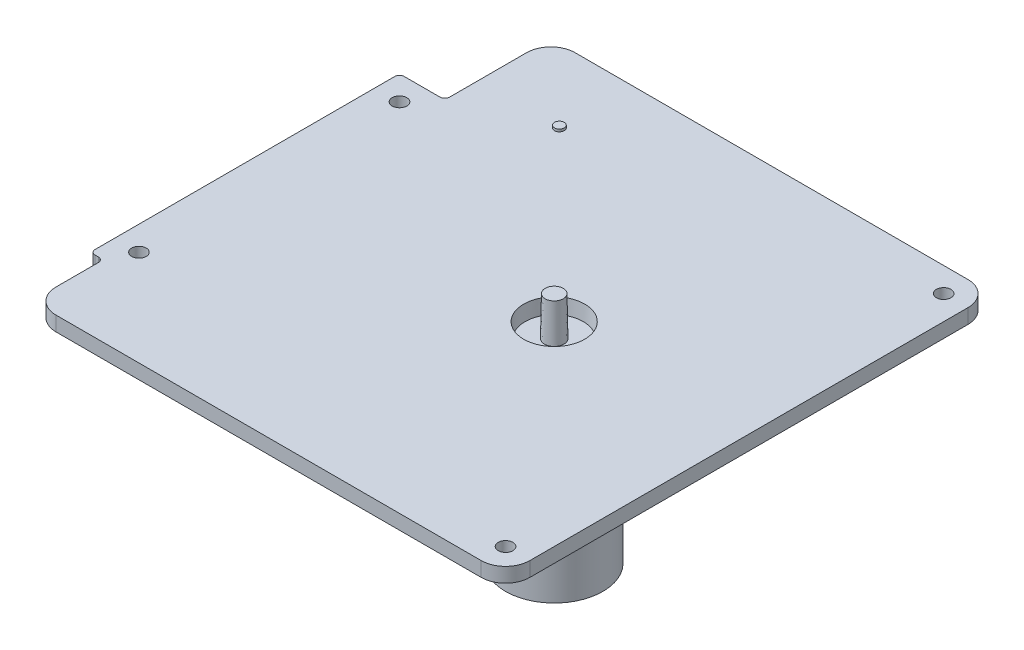
ISO-10303-21;
HEADER;
FILE_DESCRIPTION(('STEP AP214'),'2;1');
FILE_NAME('part.step','',(''),(''),'','','');
FILE_SCHEMA(('AUTOMOTIVE_DESIGN { 1 0 10303 214 1 1 1 1 }'));
ENDSEC;
DATA;
#1=APPLICATION_CONTEXT('core data for automotive mechanical design processes');
#2=APPLICATION_PROTOCOL_DEFINITION('international standard','automotive_design',2000,#1);
#3=PRODUCT_CONTEXT('',#1,'mechanical');
#4=PRODUCT('Part','Part','',(#3));
#5=PRODUCT_RELATED_PRODUCT_CATEGORY('part','',(#4));
#6=PRODUCT_DEFINITION_FORMATION('','',#4);
#7=PRODUCT_DEFINITION_CONTEXT('part definition',#1,'design');
#8=PRODUCT_DEFINITION('design','',#6,#7);
#9=PRODUCT_DEFINITION_SHAPE('','',#8);
#10=(LENGTH_UNIT() NAMED_UNIT(*) SI_UNIT(.MILLI.,.METRE.));
#11=(NAMED_UNIT(*) PLANE_ANGLE_UNIT() SI_UNIT($,.RADIAN.));
#12=(NAMED_UNIT(*) SI_UNIT($,.STERADIAN.) SOLID_ANGLE_UNIT());
#13=UNCERTAINTY_MEASURE_WITH_UNIT(LENGTH_MEASURE(1.E-05),#10,'distance_accuracy_value','');
#14=(GEOMETRIC_REPRESENTATION_CONTEXT(3) GLOBAL_UNCERTAINTY_ASSIGNED_CONTEXT((#13)) GLOBAL_UNIT_ASSIGNED_CONTEXT((#10,
#11,#12)) REPRESENTATION_CONTEXT('',''));
#15=CARTESIAN_POINT('',(0.,0.,0.));
#16=DIRECTION('',(0.,0.,1.));
#17=DIRECTION('',(1.,0.,0.));
#18=AXIS2_PLACEMENT_3D('',#15,#16,#17);
#19=CARTESIAN_POINT('',(189.,26.,-50.));
#20=DIRECTION('',(-1.,0.,0.));
#21=DIRECTION('',(0.,0.,1.));
#22=AXIS2_PLACEMENT_3D('',#19,#20,#21);
#23=PLANE('',#22);
#24=DIRECTION('',(0.,0.,-1.));
#25=VECTOR('',#24,1.);
#26=CARTESIAN_POINT('',(189.,23.,-50.));
#27=LINE('',#26,#25);
#28=CARTESIAN_POINT('',(189.,23.,45.));
#29=VERTEX_POINT('',#28);
#30=CARTESIAN_POINT('',(189.,23.,-45.));
#31=VERTEX_POINT('',#30);
#32=EDGE_CURVE('E179',#29,#31,#27,.T.);
#33=ORIENTED_EDGE('',*,*,#32,.T.);
#34=DIRECTION('',(0.,-1.,0.));
#35=VECTOR('',#34,1.);
#36=CARTESIAN_POINT('',(189.,26.,-45.));
#37=LINE('',#36,#35);
#38=CARTESIAN_POINT('',(189.,26.,-45.));
#39=VERTEX_POINT('',#38);
#40=EDGE_CURVE('E156',#31,#39,#37,.F.);
#41=ORIENTED_EDGE('',*,*,#40,.T.);
#42=DIRECTION('',(0.,0.,-1.));
#43=VECTOR('',#42,1.);
#44=CARTESIAN_POINT('',(189.,26.,-50.));
#45=LINE('',#44,#43);
#46=CARTESIAN_POINT('',(189.,26.,45.));
#47=VERTEX_POINT('',#46);
#48=EDGE_CURVE('E200',#47,#39,#45,.T.);
#49=ORIENTED_EDGE('',*,*,#48,.F.);
#50=DIRECTION('',(0.,-1.,0.));
#51=VECTOR('',#50,1.);
#52=CARTESIAN_POINT('',(189.,26.,45.));
#53=LINE('',#52,#51);
#54=EDGE_CURVE('E161',#47,#29,#53,.T.);
#55=ORIENTED_EDGE('',*,*,#54,.T.);
#56=EDGE_LOOP('',(#33,#41,#49,#55));
#57=FACE_BOUND('',#56,.T.);
#58=ADVANCED_FACE('F36',(#57),#23,.F.);
#59=CARTESIAN_POINT('',(189.,26.,-50.));
#60=DIRECTION('',(0.,0.,1.));
#61=DIRECTION('',(1.,0.,0.));
#62=AXIS2_PLACEMENT_3D('',#59,#60,#61);
#63=PLANE('',#62);
#64=DIRECTION('',(-1.,0.,0.));
#65=VECTOR('',#64,1.);
#66=CARTESIAN_POINT('',(189.,26.,-50.));
#67=LINE('',#66,#65);
#68=CARTESIAN_POINT('',(184.,26.,-50.));
#69=VERTEX_POINT('',#68);
#70=CARTESIAN_POINT('',(103.305417602381,26.,-50.));
#71=VERTEX_POINT('',#70);
#72=EDGE_CURVE('E171',#69,#71,#67,.T.);
#73=ORIENTED_EDGE('',*,*,#72,.F.);
#74=DIRECTION('',(0.,-1.,0.));
#75=VECTOR('',#74,1.);
#76=CARTESIAN_POINT('',(184.,26.,-50.));
#77=LINE('',#76,#75);
#78=CARTESIAN_POINT('',(184.,23.,-50.));
#79=VERTEX_POINT('',#78);
#80=EDGE_CURVE('E155',#69,#79,#77,.T.);
#81=ORIENTED_EDGE('',*,*,#80,.T.);
#82=DIRECTION('',(-1.,0.,0.));
#83=VECTOR('',#82,1.);
#84=CARTESIAN_POINT('',(189.,23.,-50.));
#85=LINE('',#84,#83);
#86=CARTESIAN_POINT('',(103.305417602381,23.,-50.));
#87=VERTEX_POINT('',#86);
#88=EDGE_CURVE('E168',#79,#87,#85,.T.);
#89=ORIENTED_EDGE('',*,*,#88,.T.);
#90=DIRECTION('',(0.,-1.,0.));
#91=VECTOR('',#90,1.);
#92=CARTESIAN_POINT('',(103.305417602381,26.,-50.));
#93=LINE('',#92,#91);
#94=EDGE_CURVE('E173',#87,#71,#93,.F.);
#95=ORIENTED_EDGE('',*,*,#94,.T.);
#96=EDGE_LOOP('',(#73,#81,#89,#95));
#97=FACE_BOUND('',#96,.T.);
#98=ADVANCED_FACE('F167',(#97),#63,.F.);
#99=CARTESIAN_POINT('',(98.3054176023806,26.,-50.));
#100=DIRECTION('',(1.,0.,0.));
#101=DIRECTION('',(0.,0.,-1.));
#102=AXIS2_PLACEMENT_3D('',#99,#100,#101);
#103=PLANE('',#102);
#104=DIRECTION('',(0.,0.,1.));
#105=VECTOR('',#104,1.);
#106=CARTESIAN_POINT('',(98.3054176023806,23.,-50.));
#107=LINE('',#106,#105);
#108=CARTESIAN_POINT('',(98.3054176023806,23.,-45.));
#109=VERTEX_POINT('',#108);
#110=CARTESIAN_POINT('',(98.3054176023806,23.,-29.219474586396));
#111=VERTEX_POINT('',#110);
#112=EDGE_CURVE('E178',#109,#111,#107,.T.);
#113=ORIENTED_EDGE('',*,*,#112,.T.);
#114=DIRECTION('',(0.,-1.,0.));
#115=VECTOR('',#114,1.);
#116=CARTESIAN_POINT('',(98.3054176023806,26.,-29.219474586396));
#117=LINE('',#116,#115);
#118=CARTESIAN_POINT('',(98.3054176023806,26.,-29.219474586396));
#119=VERTEX_POINT('',#118);
#120=EDGE_CURVE('E248',#111,#119,#117,.F.);
#121=ORIENTED_EDGE('',*,*,#120,.T.);
#122=DIRECTION('',(0.,0.,1.));
#123=VECTOR('',#122,1.);
#124=CARTESIAN_POINT('',(98.3054176023806,26.,-50.));
#125=LINE('',#124,#123);
#126=CARTESIAN_POINT('',(98.3054176023806,26.,-45.));
#127=VERTEX_POINT('',#126);
#128=EDGE_CURVE('E303',#127,#119,#125,.T.);
#129=ORIENTED_EDGE('',*,*,#128,.F.);
#130=DIRECTION('',(0.,-1.,0.));
#131=VECTOR('',#130,1.);
#132=CARTESIAN_POINT('',(98.3054176023806,26.,-45.));
#133=LINE('',#132,#131);
#134=EDGE_CURVE('E219',#127,#109,#133,.T.);
#135=ORIENTED_EDGE('',*,*,#134,.T.);
#136=EDGE_LOOP('',(#113,#121,#129,#135));
#137=FACE_BOUND('',#136,.T.);
#138=ADVANCED_FACE('F355',(#137),#103,.F.);
#139=CARTESIAN_POINT('',(98.3054176023806,26.,-28.219474586396));
#140=DIRECTION('',(0.,0.,1.));
#141=DIRECTION('',(1.,0.,0.));
#142=AXIS2_PLACEMENT_3D('',#139,#140,#141);
#143=PLANE('',#142);
#144=DIRECTION('',(-1.,0.,0.));
#145=VECTOR('',#144,1.);
#146=CARTESIAN_POINT('',(98.3054176023806,23.,-28.219474586396));
#147=LINE('',#146,#145);
#148=CARTESIAN_POINT('',(97.3054176023806,23.,-28.219474586396));
#149=VERTEX_POINT('',#148);
#150=CARTESIAN_POINT('',(90.,23.,-28.219474586396));
#151=VERTEX_POINT('',#150);
#152=EDGE_CURVE('E182',#149,#151,#147,.T.);
#153=ORIENTED_EDGE('',*,*,#152,.T.);
#154=DIRECTION('',(0.,-1.,0.));
#155=VECTOR('',#154,1.);
#156=CARTESIAN_POINT('',(90.,26.,-28.219474586396));
#157=LINE('',#156,#155);
#158=CARTESIAN_POINT('',(90.,26.,-28.219474586396));
#159=VERTEX_POINT('',#158);
#160=EDGE_CURVE('E242',#151,#159,#157,.F.);
#161=ORIENTED_EDGE('',*,*,#160,.T.);
#162=DIRECTION('',(-1.,0.,0.));
#163=VECTOR('',#162,1.);
#164=CARTESIAN_POINT('',(98.3054176023806,26.,-28.219474586396));
#165=LINE('',#164,#163);
#166=CARTESIAN_POINT('',(97.3054176023806,26.,-28.219474586396));
#167=VERTEX_POINT('',#166);
#168=EDGE_CURVE('E306',#167,#159,#165,.T.);
#169=ORIENTED_EDGE('',*,*,#168,.F.);
#170=DIRECTION('',(0.,-1.,0.));
#171=VECTOR('',#170,1.);
#172=CARTESIAN_POINT('',(97.3054176023806,23.,-28.219474586396));
#173=LINE('',#172,#171);
#174=EDGE_CURVE('E239',#167,#149,#173,.T.);
#175=ORIENTED_EDGE('',*,*,#174,.T.);
#176=EDGE_LOOP('',(#153,#161,#169,#175));
#177=FACE_BOUND('',#176,.T.);
#178=ADVANCED_FACE('F386',(#177),#143,.F.);
#179=CARTESIAN_POINT('',(89.,26.,-28.219474586396));
#180=DIRECTION('',(1.,0.,0.));
#181=DIRECTION('',(0.,0.,-1.));
#182=AXIS2_PLACEMENT_3D('',#179,#180,#181);
#183=PLANE('',#182);
#184=DIRECTION('',(0.,0.,1.));
#185=VECTOR('',#184,1.);
#186=CARTESIAN_POINT('',(89.,26.,-28.219474586396));
#187=LINE('',#186,#185);
#188=CARTESIAN_POINT('',(89.,26.,-27.219474586396));
#189=VERTEX_POINT('',#188);
#190=CARTESIAN_POINT('',(89.,26.,34.3080011824122));
#191=VERTEX_POINT('',#190);
#192=EDGE_CURVE('E309',#189,#191,#187,.T.);
#193=ORIENTED_EDGE('',*,*,#192,.F.);
#194=DIRECTION('',(0.,-1.,0.));
#195=VECTOR('',#194,1.);
#196=CARTESIAN_POINT('',(89.,26.,-27.219474586396));
#197=LINE('',#196,#195);
#198=CARTESIAN_POINT('',(89.,23.,-27.219474586396));
#199=VERTEX_POINT('',#198);
#200=EDGE_CURVE('E232',#189,#199,#197,.T.);
#201=ORIENTED_EDGE('',*,*,#200,.T.);
#202=DIRECTION('',(0.,0.,1.));
#203=VECTOR('',#202,1.);
#204=CARTESIAN_POINT('',(89.,23.,-28.219474586396));
#205=LINE('',#204,#203);
#206=CARTESIAN_POINT('',(89.,23.,34.3080011824122));
#207=VERTEX_POINT('',#206);
#208=EDGE_CURVE('E190',#199,#207,#205,.T.);
#209=ORIENTED_EDGE('',*,*,#208,.T.);
#210=DIRECTION('',(0.,-1.,0.));
#211=VECTOR('',#210,1.);
#212=CARTESIAN_POINT('',(89.,26.,34.3080011824122));
#213=LINE('',#212,#211);
#214=EDGE_CURVE('E230',#207,#191,#213,.F.);
#215=ORIENTED_EDGE('',*,*,#214,.T.);
#216=EDGE_LOOP('',(#193,#201,#209,#215));
#217=FACE_BOUND('',#216,.T.);
#218=ADVANCED_FACE('F380',(#217),#183,.F.);
#219=CARTESIAN_POINT('',(89.,26.,35.3080011824122));
#220=DIRECTION('',(0.,0.,-1.));
#221=DIRECTION('',(-1.,0.,0.));
#222=AXIS2_PLACEMENT_3D('',#219,#220,#221);
#223=PLANE('',#222);
#224=DIRECTION('',(1.,0.,0.));
#225=VECTOR('',#224,1.);
#226=CARTESIAN_POINT('',(89.,23.,35.3080011824122));
#227=LINE('',#226,#225);
#228=CARTESIAN_POINT('',(90.,23.,35.3080011824122));
#229=VERTEX_POINT('',#228);
#230=CARTESIAN_POINT('',(90.6597838045087,23.,35.3080011824122));
#231=VERTEX_POINT('',#230);
#232=EDGE_CURVE('E193',#229,#231,#227,.T.);
#233=ORIENTED_EDGE('',*,*,#232,.T.);
#234=DIRECTION('',(0.,-1.,0.));
#235=VECTOR('',#234,1.);
#236=CARTESIAN_POINT('',(90.6597838045087,26.,35.3080011824122));
#237=LINE('',#236,#235);
#238=CARTESIAN_POINT('',(90.6597838045087,26.,35.3080011824122));
#239=VERTEX_POINT('',#238);
#240=EDGE_CURVE('E59',#231,#239,#237,.F.);
#241=ORIENTED_EDGE('',*,*,#240,.T.);
#242=DIRECTION('',(1.,0.,0.));
#243=VECTOR('',#242,1.);
#244=CARTESIAN_POINT('',(89.,26.,35.3080011824122));
#245=LINE('',#244,#243);
#246=CARTESIAN_POINT('',(90.,26.,35.3080011824122));
#247=VERTEX_POINT('',#246);
#248=EDGE_CURVE('E312',#247,#239,#245,.T.);
#249=ORIENTED_EDGE('',*,*,#248,.F.);
#250=DIRECTION('',(0.,-1.,0.));
#251=VECTOR('',#250,1.);
#252=CARTESIAN_POINT('',(90.,26.,35.3080011824122));
#253=LINE('',#252,#251);
#254=EDGE_CURVE('E253',#247,#229,#253,.T.);
#255=ORIENTED_EDGE('',*,*,#254,.T.);
#256=EDGE_LOOP('',(#233,#241,#249,#255));
#257=FACE_BOUND('',#256,.T.);
#258=ADVANCED_FACE('F383',(#257),#223,.F.);
#259=CARTESIAN_POINT('',(91.6597838045087,26.,35.3080011824122));
#260=DIRECTION('',(1.,0.,0.));
#261=DIRECTION('',(0.,0.,-1.));
#262=AXIS2_PLACEMENT_3D('',#259,#260,#261);
#263=PLANE('',#262);
#264=DIRECTION('',(0.,0.,1.));
#265=VECTOR('',#264,1.);
#266=CARTESIAN_POINT('',(91.6597838045087,26.,35.3080011824122));
#267=LINE('',#266,#265);
#268=CARTESIAN_POINT('',(91.6597838045087,26.,36.3080011824122));
#269=VERTEX_POINT('',#268);
#270=CARTESIAN_POINT('',(91.6597838045087,26.,45.));
#271=VERTEX_POINT('',#270);
#272=EDGE_CURVE('E314',#269,#271,#267,.T.);
#273=ORIENTED_EDGE('',*,*,#272,.F.);
#274=DIRECTION('',(0.,-1.,0.));
#275=VECTOR('',#274,1.);
#276=CARTESIAN_POINT('',(91.6597838045087,23.,36.3080011824122));
#277=LINE('',#276,#275);
#278=CARTESIAN_POINT('',(91.6597838045087,23.,36.3080011824122));
#279=VERTEX_POINT('',#278);
#280=EDGE_CURVE('E250',#269,#279,#277,.T.);
#281=ORIENTED_EDGE('',*,*,#280,.T.);
#282=DIRECTION('',(0.,0.,1.));
#283=VECTOR('',#282,1.);
#284=CARTESIAN_POINT('',(91.6597838045087,23.,35.3080011824122));
#285=LINE('',#284,#283);
#286=CARTESIAN_POINT('',(91.6597838045087,23.,45.));
#287=VERTEX_POINT('',#286);
#288=EDGE_CURVE('E195',#279,#287,#285,.T.);
#289=ORIENTED_EDGE('',*,*,#288,.T.);
#290=DIRECTION('',(0.,-1.,0.));
#291=VECTOR('',#290,1.);
#292=CARTESIAN_POINT('',(91.6597838045087,26.,45.));
#293=LINE('',#292,#291);
#294=EDGE_CURVE('E227',#287,#271,#293,.F.);
#295=ORIENTED_EDGE('',*,*,#294,.T.);
#296=EDGE_LOOP('',(#273,#281,#289,#295));
#297=FACE_BOUND('',#296,.T.);
#298=ADVANCED_FACE('F335',(#297),#263,.F.);
#299=CARTESIAN_POINT('',(189.,26.,50.));
#300=DIRECTION('',(0.,0.,-1.));
#301=DIRECTION('',(-1.,0.,0.));
#302=AXIS2_PLACEMENT_3D('',#299,#300,#301);
#303=PLANE('',#302);
#304=DIRECTION('',(1.,0.,0.));
#305=VECTOR('',#304,1.);
#306=CARTESIAN_POINT('',(91.6597838045087,26.,50.));
#307=LINE('',#306,#305);
#308=CARTESIAN_POINT('',(96.6597838045087,26.,50.));
#309=VERTEX_POINT('',#308);
#310=CARTESIAN_POINT('',(184.,26.,49.9999999999998));
#311=VERTEX_POINT('',#310);
#312=EDGE_CURVE('E201',#309,#311,#307,.T.);
#313=ORIENTED_EDGE('',*,*,#312,.F.);
#314=DIRECTION('',(0.,-1.,0.));
#315=VECTOR('',#314,1.);
#316=CARTESIAN_POINT('',(96.6597838045087,26.,50.));
#317=LINE('',#316,#315);
#318=CARTESIAN_POINT('',(96.6597838045087,23.,50.));
#319=VERTEX_POINT('',#318);
#320=EDGE_CURVE('E224',#309,#319,#317,.T.);
#321=ORIENTED_EDGE('',*,*,#320,.T.);
#322=DIRECTION('',(1.,0.,0.));
#323=VECTOR('',#322,1.);
#324=CARTESIAN_POINT('',(189.,23.,50.));
#325=LINE('',#324,#323);
#326=CARTESIAN_POINT('',(184.,23.,50.));
#327=VERTEX_POINT('',#326);
#328=EDGE_CURVE('E197',#319,#327,#325,.T.);
#329=ORIENTED_EDGE('',*,*,#328,.T.);
#330=DIRECTION('',(0.,-1.,0.));
#331=VECTOR('',#330,1.);
#332=CARTESIAN_POINT('',(184.,26.,50.));
#333=LINE('',#332,#331);
#334=EDGE_CURVE('E222',#327,#311,#333,.F.);
#335=ORIENTED_EDGE('',*,*,#334,.T.);
#336=EDGE_LOOP('',(#313,#321,#329,#335));
#337=FACE_BOUND('',#336,.T.);
#338=ADVANCED_FACE('F328',(#337),#303,.F.);
#339=CARTESIAN_POINT('',(0.,26.,0.));
#340=DIRECTION('',(0.,-1.,0.));
#341=DIRECTION('',(0.,0.,-1.));
#342=AXIS2_PLACEMENT_3D('',#339,#340,#341);
#343=PLANE('',#342);
#344=CARTESIAN_POINT('',(115.065320098754,26.,-35.));
#345=DIRECTION('',(0.,-1.,0.));
#346=DIRECTION('',(0.,0.,-1.));
#347=AXIS2_PLACEMENT_3D('',#344,#345,#346);
#348=CIRCLE('',#347,0.999999999999998);
#349=CARTESIAN_POINT('',(115.065320098754,26.,-36.));
#350=VERTEX_POINT('',#349);
#351=EDGE_CURVE('E11',#350,#350,#348,.F.);
#352=ORIENTED_EDGE('',*,*,#351,.F.);
#353=EDGE_LOOP('',(#352));
#354=FACE_BOUND('',#353,.T.);
#355=CARTESIAN_POINT('',(149.,26.,0.));
#356=DIRECTION('',(0.,1.,0.));
#357=DIRECTION('',(0.,0.,1.));
#358=AXIS2_PLACEMENT_3D('',#355,#356,#357);
#359=CIRCLE('',#358,6.26246599057779);
#360=CARTESIAN_POINT('',(149.,26.,6.26246599057779));
#361=VERTEX_POINT('',#360);
#362=EDGE_CURVE('E294',#361,#361,#359,.T.);
#363=ORIENTED_EDGE('',*,*,#362,.F.);
#364=EDGE_LOOP('',(#363));
#365=FACE_BOUND('',#364,.T.);
#366=CARTESIAN_POINT('',(184.,26.,45.));
#367=DIRECTION('',(0.,-1.,0.));
#368=DIRECTION('',(0.,0.,-1.));
#369=AXIS2_PLACEMENT_3D('',#366,#367,#368);
#370=CIRCLE('',#369,1.5);
#371=CARTESIAN_POINT('',(184.,26.,43.5));
#372=VERTEX_POINT('',#371);
#373=EDGE_CURVE('E184',#372,#372,#370,.T.);
#374=ORIENTED_EDGE('',*,*,#373,.T.);
#375=EDGE_LOOP('',(#374));
#376=FACE_BOUND('',#375,.T.);
#377=CARTESIAN_POINT('',(94.,26.,30.3080011824122));
#378=DIRECTION('',(0.,-1.,0.));
#379=DIRECTION('',(0.,0.,-1.));
#380=AXIS2_PLACEMENT_3D('',#377,#378,#379);
#381=CIRCLE('',#380,1.5);
#382=CARTESIAN_POINT('',(94.,26.,28.8080011824122));
#383=VERTEX_POINT('',#382);
#384=EDGE_CURVE('E475',#383,#383,#381,.T.);
#385=ORIENTED_EDGE('',*,*,#384,.T.);
#386=EDGE_LOOP('',(#385));
#387=FACE_BOUND('',#386,.T.);
#388=CARTESIAN_POINT('',(94.,26.,-23.219474586396));
#389=DIRECTION('',(0.,-1.,0.));
#390=DIRECTION('',(0.,0.,-1.));
#391=AXIS2_PLACEMENT_3D('',#388,#389,#390);
#392=CIRCLE('',#391,1.5);
#393=CARTESIAN_POINT('',(94.,26.,-24.719474586396));
#394=VERTEX_POINT('',#393);
#395=EDGE_CURVE('E297',#394,#394,#392,.T.);
#396=ORIENTED_EDGE('',*,*,#395,.T.);
#397=EDGE_LOOP('',(#396));
#398=FACE_BOUND('',#397,.T.);
#399=CARTESIAN_POINT('',(184.,26.,-45.));
#400=DIRECTION('',(0.,-1.,0.));
#401=DIRECTION('',(0.,0.,-1.));
#402=AXIS2_PLACEMENT_3D('',#399,#400,#401);
#403=CIRCLE('',#402,1.5);
#404=CARTESIAN_POINT('',(184.,26.,-46.5));
#405=VERTEX_POINT('',#404);
#406=EDGE_CURVE('E288',#405,#405,#403,.T.);
#407=ORIENTED_EDGE('',*,*,#406,.T.);
#408=EDGE_LOOP('',(#407));
#409=FACE_BOUND('',#408,.T.);
#410=ORIENTED_EDGE('',*,*,#168,.T.);
#411=CARTESIAN_POINT('',(90.,26.,-27.219474586396));
#412=DIRECTION('',(0.,-1.,0.));
#413=DIRECTION('',(0.,0.,-1.));
#414=AXIS2_PLACEMENT_3D('',#411,#412,#413);
#415=CIRCLE('',#414,1.);
#416=EDGE_CURVE('E246',#159,#189,#415,.F.);
#417=ORIENTED_EDGE('',*,*,#416,.T.);
#418=ORIENTED_EDGE('',*,*,#192,.T.);
#419=CARTESIAN_POINT('',(90.,26.,34.3080011824122));
#420=DIRECTION('',(0.,-1.,0.));
#421=DIRECTION('',(0.,0.,-1.));
#422=AXIS2_PLACEMENT_3D('',#419,#420,#421);
#423=CIRCLE('',#422,1.);
#424=EDGE_CURVE('E244',#191,#247,#423,.F.);
#425=ORIENTED_EDGE('',*,*,#424,.T.);
#426=ORIENTED_EDGE('',*,*,#248,.T.);
#427=CARTESIAN_POINT('',(90.6597838045087,26.,36.3080011824122));
#428=DIRECTION('',(0.,-1.,0.));
#429=DIRECTION('',(0.,0.,-1.));
#430=AXIS2_PLACEMENT_3D('',#427,#428,#429);
#431=CIRCLE('',#430,1.);
#432=EDGE_CURVE('E51',#239,#269,#431,.T.);
#433=ORIENTED_EDGE('',*,*,#432,.T.);
#434=ORIENTED_EDGE('',*,*,#272,.T.);
#435=CARTESIAN_POINT('',(96.6597838045087,26.,45.));
#436=DIRECTION('',(0.,-1.,0.));
#437=DIRECTION('',(0.,0.,-1.));
#438=AXIS2_PLACEMENT_3D('',#435,#436,#437);
#439=CIRCLE('',#438,5.);
#440=EDGE_CURVE('E213',#271,#309,#439,.F.);
#441=ORIENTED_EDGE('',*,*,#440,.T.);
#442=ORIENTED_EDGE('',*,*,#312,.T.);
#443=CARTESIAN_POINT('',(184.,26.,45.));
#444=DIRECTION('',(0.,-1.,0.));
#445=DIRECTION('',(0.,0.,-1.));
#446=AXIS2_PLACEMENT_3D('',#443,#444,#445);
#447=CIRCLE('',#446,5.);
#448=EDGE_CURVE('E211',#311,#47,#447,.F.);
#449=ORIENTED_EDGE('',*,*,#448,.T.);
#450=ORIENTED_EDGE('',*,*,#48,.T.);
#451=CARTESIAN_POINT('',(184.,26.,-45.));
#452=DIRECTION('',(0.,-1.,0.));
#453=DIRECTION('',(0.,0.,-1.));
#454=AXIS2_PLACEMENT_3D('',#451,#452,#453);
#455=CIRCLE('',#454,5.);
#456=EDGE_CURVE('E217',#39,#69,#455,.F.);
#457=ORIENTED_EDGE('',*,*,#456,.T.);
#458=ORIENTED_EDGE('',*,*,#72,.T.);
#459=CARTESIAN_POINT('',(103.305417602381,26.,-45.));
#460=DIRECTION('',(0.,-1.,0.));
#461=DIRECTION('',(0.,0.,-1.));
#462=AXIS2_PLACEMENT_3D('',#459,#460,#461);
#463=CIRCLE('',#462,5.);
#464=EDGE_CURVE('E215',#71,#127,#463,.F.);
#465=ORIENTED_EDGE('',*,*,#464,.T.);
#466=ORIENTED_EDGE('',*,*,#128,.T.);
#467=CARTESIAN_POINT('',(97.3054176023806,26.,-29.219474586396));
#468=DIRECTION('',(0.,-1.,0.));
#469=DIRECTION('',(0.,0.,-1.));
#470=AXIS2_PLACEMENT_3D('',#467,#468,#469);
#471=CIRCLE('',#470,1.);
#472=EDGE_CURVE('E259',#119,#167,#471,.T.);
#473=ORIENTED_EDGE('',*,*,#472,.T.);
#474=EDGE_LOOP('',(#410,#417,#418,#425,#426,#433,#434,#441,#442,#449,#450,#457,#458,#465,#466,#473));
#475=FACE_BOUND('',#474,.T.);
#476=ADVANCED_FACE('F270',(#354,#365,#376,#387,#398,#409,#475),#343,.F.);
#477=CARTESIAN_POINT('',(0.,23.,0.));
#478=DIRECTION('',(0.,-1.,0.));
#479=DIRECTION('',(0.,0.,-1.));
#480=AXIS2_PLACEMENT_3D('',#477,#478,#479);
#481=PLANE('',#480);
#482=CARTESIAN_POINT('',(149.,23.,0.));
#483=DIRECTION('',(0.,-1.,0.));
#484=DIRECTION('',(0.,0.,-1.));
#485=AXIS2_PLACEMENT_3D('',#482,#483,#484);
#486=CIRCLE('',#485,10.);
#487=CARTESIAN_POINT('',(149.,23.,-10.));
#488=VERTEX_POINT('',#487);
#489=EDGE_CURVE('E44',#488,#488,#486,.T.);
#490=ORIENTED_EDGE('',*,*,#489,.F.);
#491=EDGE_LOOP('',(#490));
#492=FACE_BOUND('',#491,.T.);
#493=CARTESIAN_POINT('',(184.,23.,45.));
#494=DIRECTION('',(0.,1.,0.));
#495=DIRECTION('',(0.,0.,1.));
#496=AXIS2_PLACEMENT_3D('',#493,#494,#495);
#497=CIRCLE('',#496,1.5);
#498=CARTESIAN_POINT('',(184.,23.,46.5));
#499=VERTEX_POINT('',#498);
#500=EDGE_CURVE('E275',#499,#499,#497,.T.);
#501=ORIENTED_EDGE('',*,*,#500,.T.);
#502=EDGE_LOOP('',(#501));
#503=FACE_BOUND('',#502,.T.);
#504=CARTESIAN_POINT('',(94.,23.,30.3080011824122));
#505=DIRECTION('',(0.,1.,0.));
#506=DIRECTION('',(0.,0.,1.));
#507=AXIS2_PLACEMENT_3D('',#504,#505,#506);
#508=CIRCLE('',#507,1.5);
#509=CARTESIAN_POINT('',(94.,23.,31.8080011824122));
#510=VERTEX_POINT('',#509);
#511=EDGE_CURVE('E279',#510,#510,#508,.T.);
#512=ORIENTED_EDGE('',*,*,#511,.T.);
#513=EDGE_LOOP('',(#512));
#514=FACE_BOUND('',#513,.T.);
#515=CARTESIAN_POINT('',(94.,23.,-23.219474586396));
#516=DIRECTION('',(0.,1.,0.));
#517=DIRECTION('',(0.,0.,1.));
#518=AXIS2_PLACEMENT_3D('',#515,#516,#517);
#519=CIRCLE('',#518,1.5);
#520=CARTESIAN_POINT('',(94.,23.,-21.719474586396));
#521=VERTEX_POINT('',#520);
#522=EDGE_CURVE('E283',#521,#521,#519,.T.);
#523=ORIENTED_EDGE('',*,*,#522,.T.);
#524=EDGE_LOOP('',(#523));
#525=FACE_BOUND('',#524,.T.);
#526=CARTESIAN_POINT('',(184.,23.,-45.));
#527=DIRECTION('',(0.,1.,0.));
#528=DIRECTION('',(0.,0.,1.));
#529=AXIS2_PLACEMENT_3D('',#526,#527,#528);
#530=CIRCLE('',#529,1.5);
#531=CARTESIAN_POINT('',(184.,23.,-43.5));
#532=VERTEX_POINT('',#531);
#533=EDGE_CURVE('E286',#532,#532,#530,.T.);
#534=ORIENTED_EDGE('',*,*,#533,.T.);
#535=EDGE_LOOP('',(#534));
#536=FACE_BOUND('',#535,.T.);
#537=ORIENTED_EDGE('',*,*,#208,.F.);
#538=CARTESIAN_POINT('',(90.,23.,-27.219474586396));
#539=DIRECTION('',(0.,-1.,0.));
#540=DIRECTION('',(0.,0.,-1.));
#541=AXIS2_PLACEMENT_3D('',#538,#539,#540);
#542=CIRCLE('',#541,1.);
#543=EDGE_CURVE('E237',#199,#151,#542,.T.);
#544=ORIENTED_EDGE('',*,*,#543,.T.);
#545=ORIENTED_EDGE('',*,*,#152,.F.);
#546=CARTESIAN_POINT('',(97.3054176023806,23.,-29.219474586396));
#547=DIRECTION('',(0.,-1.,0.));
#548=DIRECTION('',(0.,0.,-1.));
#549=AXIS2_PLACEMENT_3D('',#546,#547,#548);
#550=CIRCLE('',#549,1.);
#551=EDGE_CURVE('E257',#149,#111,#550,.F.);
#552=ORIENTED_EDGE('',*,*,#551,.T.);
#553=ORIENTED_EDGE('',*,*,#112,.F.);
#554=CARTESIAN_POINT('',(103.305417602381,23.,-45.));
#555=DIRECTION('',(0.,-1.,0.));
#556=DIRECTION('',(0.,0.,-1.));
#557=AXIS2_PLACEMENT_3D('',#554,#555,#556);
#558=CIRCLE('',#557,5.);
#559=EDGE_CURVE('E162',#109,#87,#558,.T.);
#560=ORIENTED_EDGE('',*,*,#559,.T.);
#561=ORIENTED_EDGE('',*,*,#88,.F.);
#562=CARTESIAN_POINT('',(184.,23.,-45.));
#563=DIRECTION('',(0.,-1.,0.));
#564=DIRECTION('',(0.,0.,-1.));
#565=AXIS2_PLACEMENT_3D('',#562,#563,#564);
#566=CIRCLE('',#565,5.);
#567=EDGE_CURVE('E151',#79,#31,#566,.T.);
#568=ORIENTED_EDGE('',*,*,#567,.T.);
#569=ORIENTED_EDGE('',*,*,#32,.F.);
#570=CARTESIAN_POINT('',(184.,23.,45.));
#571=DIRECTION('',(0.,-1.,0.));
#572=DIRECTION('',(0.,0.,-1.));
#573=AXIS2_PLACEMENT_3D('',#570,#571,#572);
#574=CIRCLE('',#573,5.);
#575=EDGE_CURVE('E172',#29,#327,#574,.T.);
#576=ORIENTED_EDGE('',*,*,#575,.T.);
#577=ORIENTED_EDGE('',*,*,#328,.F.);
#578=CARTESIAN_POINT('',(96.6597838045087,23.,45.));
#579=DIRECTION('',(0.,-1.,0.));
#580=DIRECTION('',(0.,0.,-1.));
#581=AXIS2_PLACEMENT_3D('',#578,#579,#580);
#582=CIRCLE('',#581,5.);
#583=EDGE_CURVE('E204',#319,#287,#582,.T.);
#584=ORIENTED_EDGE('',*,*,#583,.T.);
#585=ORIENTED_EDGE('',*,*,#288,.F.);
#586=CARTESIAN_POINT('',(90.6597838045087,23.,36.3080011824122));
#587=DIRECTION('',(0.,-1.,0.));
#588=DIRECTION('',(0.,0.,-1.));
#589=AXIS2_PLACEMENT_3D('',#586,#587,#588);
#590=CIRCLE('',#589,1.);
#591=EDGE_CURVE('E261',#279,#231,#590,.F.);
#592=ORIENTED_EDGE('',*,*,#591,.T.);
#593=ORIENTED_EDGE('',*,*,#232,.F.);
#594=CARTESIAN_POINT('',(90.,23.,34.3080011824122));
#595=DIRECTION('',(0.,-1.,0.));
#596=DIRECTION('',(0.,0.,-1.));
#597=AXIS2_PLACEMENT_3D('',#594,#595,#596);
#598=CIRCLE('',#597,1.);
#599=EDGE_CURVE('E235',#229,#207,#598,.T.);
#600=ORIENTED_EDGE('',*,*,#599,.T.);
#601=EDGE_LOOP('',(#537,#544,#545,#552,#553,#560,#561,#568,#569,#576,#577,#584,#585,#592,#593,#600));
#602=FACE_BOUND('',#601,.T.);
#603=ADVANCED_FACE('F176',(#492,#503,#514,#525,#536,#602),#481,.T.);
#604=CARTESIAN_POINT('',(184.,26.,-45.));
#605=DIRECTION('',(0.,-1.,0.));
#606=DIRECTION('',(0.,0.,-1.));
#607=AXIS2_PLACEMENT_3D('',#604,#605,#606);
#608=CYLINDRICAL_SURFACE('',#607,5.);
#609=ORIENTED_EDGE('',*,*,#456,.F.);
#610=ORIENTED_EDGE('',*,*,#40,.F.);
#611=ORIENTED_EDGE('',*,*,#567,.F.);
#612=ORIENTED_EDGE('',*,*,#80,.F.);
#613=EDGE_LOOP('',(#609,#610,#611,#612));
#614=FACE_BOUND('',#613,.T.);
#615=ADVANCED_FACE('F154',(#614),#608,.T.);
#616=CARTESIAN_POINT('',(103.305417602381,26.,-45.));
#617=DIRECTION('',(0.,-1.,0.));
#618=DIRECTION('',(0.,0.,-1.));
#619=AXIS2_PLACEMENT_3D('',#616,#617,#618);
#620=CYLINDRICAL_SURFACE('',#619,5.);
#621=ORIENTED_EDGE('',*,*,#464,.F.);
#622=ORIENTED_EDGE('',*,*,#94,.F.);
#623=ORIENTED_EDGE('',*,*,#559,.F.);
#624=ORIENTED_EDGE('',*,*,#134,.F.);
#625=EDGE_LOOP('',(#621,#622,#623,#624));
#626=FACE_BOUND('',#625,.T.);
#627=ADVANCED_FACE('F361',(#626),#620,.T.);
#628=CARTESIAN_POINT('',(96.6597838045087,26.,45.));
#629=DIRECTION('',(0.,-1.,0.));
#630=DIRECTION('',(0.,0.,-1.));
#631=AXIS2_PLACEMENT_3D('',#628,#629,#630);
#632=CYLINDRICAL_SURFACE('',#631,5.);
#633=ORIENTED_EDGE('',*,*,#440,.F.);
#634=ORIENTED_EDGE('',*,*,#294,.F.);
#635=ORIENTED_EDGE('',*,*,#583,.F.);
#636=ORIENTED_EDGE('',*,*,#320,.F.);
#637=EDGE_LOOP('',(#633,#634,#635,#636));
#638=FACE_BOUND('',#637,.T.);
#639=ADVANCED_FACE('F330',(#638),#632,.T.);
#640=CARTESIAN_POINT('',(184.,26.,45.));
#641=DIRECTION('',(0.,-1.,0.));
#642=DIRECTION('',(0.,0.,-1.));
#643=AXIS2_PLACEMENT_3D('',#640,#641,#642);
#644=CYLINDRICAL_SURFACE('',#643,5.);
#645=ORIENTED_EDGE('',*,*,#448,.F.);
#646=ORIENTED_EDGE('',*,*,#334,.F.);
#647=ORIENTED_EDGE('',*,*,#575,.F.);
#648=ORIENTED_EDGE('',*,*,#54,.F.);
#649=EDGE_LOOP('',(#645,#646,#647,#648));
#650=FACE_BOUND('',#649,.T.);
#651=ADVANCED_FACE('F325',(#650),#644,.T.);
#652=CARTESIAN_POINT('',(90.,26.,-27.219474586396));
#653=DIRECTION('',(0.,-1.,0.));
#654=DIRECTION('',(0.,0.,-1.));
#655=AXIS2_PLACEMENT_3D('',#652,#653,#654);
#656=CYLINDRICAL_SURFACE('',#655,1.);
#657=ORIENTED_EDGE('',*,*,#416,.F.);
#658=ORIENTED_EDGE('',*,*,#160,.F.);
#659=ORIENTED_EDGE('',*,*,#543,.F.);
#660=ORIENTED_EDGE('',*,*,#200,.F.);
#661=EDGE_LOOP('',(#657,#658,#659,#660));
#662=FACE_BOUND('',#661,.T.);
#663=ADVANCED_FACE('F347',(#662),#656,.T.);
#664=CARTESIAN_POINT('',(97.3054176023806,26.,-29.219474586396));
#665=DIRECTION('',(0.,1.,0.));
#666=DIRECTION('',(0.,0.,1.));
#667=AXIS2_PLACEMENT_3D('',#664,#665,#666);
#668=CYLINDRICAL_SURFACE('',#667,1.);
#669=ORIENTED_EDGE('',*,*,#472,.F.);
#670=ORIENTED_EDGE('',*,*,#120,.F.);
#671=ORIENTED_EDGE('',*,*,#551,.F.);
#672=ORIENTED_EDGE('',*,*,#174,.F.);
#673=EDGE_LOOP('',(#669,#670,#671,#672));
#674=FACE_BOUND('',#673,.T.);
#675=ADVANCED_FACE('F340',(#674),#668,.F.);
#676=CARTESIAN_POINT('',(90.6597838045087,26.,36.3080011824122));
#677=DIRECTION('',(0.,1.,0.));
#678=DIRECTION('',(0.,0.,1.));
#679=AXIS2_PLACEMENT_3D('',#676,#677,#678);
#680=CYLINDRICAL_SURFACE('',#679,1.);
#681=ORIENTED_EDGE('',*,*,#432,.F.);
#682=ORIENTED_EDGE('',*,*,#240,.F.);
#683=ORIENTED_EDGE('',*,*,#591,.F.);
#684=ORIENTED_EDGE('',*,*,#280,.F.);
#685=EDGE_LOOP('',(#681,#682,#683,#684));
#686=FACE_BOUND('',#685,.T.);
#687=ADVANCED_FACE('F338',(#686),#680,.F.);
#688=CARTESIAN_POINT('',(90.,26.,34.3080011824122));
#689=DIRECTION('',(0.,-1.,0.));
#690=DIRECTION('',(0.,0.,-1.));
#691=AXIS2_PLACEMENT_3D('',#688,#689,#690);
#692=CYLINDRICAL_SURFACE('',#691,1.);
#693=ORIENTED_EDGE('',*,*,#424,.F.);
#694=ORIENTED_EDGE('',*,*,#214,.F.);
#695=ORIENTED_EDGE('',*,*,#599,.F.);
#696=ORIENTED_EDGE('',*,*,#254,.F.);
#697=EDGE_LOOP('',(#693,#694,#695,#696));
#698=FACE_BOUND('',#697,.T.);
#699=ADVANCED_FACE('F38',(#698),#692,.T.);
#700=CARTESIAN_POINT('',(184.,30.2426406871193,-45.));
#701=DIRECTION('',(0.,-1.,0.));
#702=DIRECTION('',(0.,0.,-1.));
#703=AXIS2_PLACEMENT_3D('',#700,#701,#702);
#704=CYLINDRICAL_SURFACE('',#703,1.5);
#705=ORIENTED_EDGE('',*,*,#406,.F.);
#706=EDGE_LOOP('',(#705));
#707=FACE_BOUND('',#706,.T.);
#708=ORIENTED_EDGE('',*,*,#533,.F.);
#709=EDGE_LOOP('',(#708));
#710=FACE_BOUND('',#709,.T.);
#711=ADVANCED_FACE('F345',(#707,#710),#704,.F.);
#712=CARTESIAN_POINT('',(94.,30.2426406871193,-23.219474586396));
#713=DIRECTION('',(0.,-1.,0.));
#714=DIRECTION('',(0.,0.,-1.));
#715=AXIS2_PLACEMENT_3D('',#712,#713,#714);
#716=CYLINDRICAL_SURFACE('',#715,1.5);
#717=ORIENTED_EDGE('',*,*,#395,.F.);
#718=EDGE_LOOP('',(#717));
#719=FACE_BOUND('',#718,.T.);
#720=ORIENTED_EDGE('',*,*,#522,.F.);
#721=EDGE_LOOP('',(#720));
#722=FACE_BOUND('',#721,.T.);
#723=ADVANCED_FACE('F413',(#719,#722),#716,.F.);
#724=CARTESIAN_POINT('',(94.,30.2426406871193,30.3080011824122));
#725=DIRECTION('',(0.,-1.,0.));
#726=DIRECTION('',(0.,0.,-1.));
#727=AXIS2_PLACEMENT_3D('',#724,#725,#726);
#728=CYLINDRICAL_SURFACE('',#727,1.5);
#729=ORIENTED_EDGE('',*,*,#384,.F.);
#730=EDGE_LOOP('',(#729));
#731=FACE_BOUND('',#730,.T.);
#732=ORIENTED_EDGE('',*,*,#511,.F.);
#733=EDGE_LOOP('',(#732));
#734=FACE_BOUND('',#733,.T.);
#735=ADVANCED_FACE('F417',(#731,#734),#728,.F.);
#736=CARTESIAN_POINT('',(184.,30.2426406871193,45.));
#737=DIRECTION('',(0.,-1.,0.));
#738=DIRECTION('',(0.,0.,-1.));
#739=AXIS2_PLACEMENT_3D('',#736,#737,#738);
#740=CYLINDRICAL_SURFACE('',#739,1.5);
#741=ORIENTED_EDGE('',*,*,#373,.F.);
#742=EDGE_LOOP('',(#741));
#743=FACE_BOUND('',#742,.T.);
#744=ORIENTED_EDGE('',*,*,#500,.F.);
#745=EDGE_LOOP('',(#744));
#746=FACE_BOUND('',#745,.T.);
#747=ADVANCED_FACE('F421',(#743,#746),#740,.F.);
#748=CARTESIAN_POINT('',(149.,-17.,0.));
#749=DIRECTION('',(0.,1.,0.));
#750=DIRECTION('',(0.,0.,1.));
#751=AXIS2_PLACEMENT_3D('',#748,#749,#750);
#752=CYLINDRICAL_SURFACE('',#751,10.);
#753=CARTESIAN_POINT('',(149.,-17.,0.));
#754=DIRECTION('',(0.,1.,0.));
#755=DIRECTION('',(0.,0.,1.));
#756=AXIS2_PLACEMENT_3D('',#753,#754,#755);
#757=CIRCLE('',#756,10.);
#758=CARTESIAN_POINT('',(149.,-17.,10.));
#759=VERTEX_POINT('',#758);
#760=EDGE_CURVE('E289',#759,#759,#757,.T.);
#761=ORIENTED_EDGE('',*,*,#760,.T.);
#762=EDGE_LOOP('',(#761));
#763=FACE_BOUND('',#762,.T.);
#764=ORIENTED_EDGE('',*,*,#489,.T.);
#765=EDGE_LOOP('',(#764));
#766=FACE_BOUND('',#765,.T.);
#767=ADVANCED_FACE('F266',(#763,#766),#752,.T.);
#768=CARTESIAN_POINT('',(149.,-17.,0.));
#769=DIRECTION('',(0.,1.,0.));
#770=DIRECTION('',(0.,0.,1.));
#771=AXIS2_PLACEMENT_3D('',#768,#769,#770);
#772=PLANE('',#771);
#773=ORIENTED_EDGE('',*,*,#760,.F.);
#774=EDGE_LOOP('',(#773));
#775=FACE_BOUND('',#774,.T.);
#776=ADVANCED_FACE('F428',(#775),#772,.F.);
#777=CARTESIAN_POINT('',(149.,23.,0.));
#778=DIRECTION('',(0.,1.,0.));
#779=DIRECTION('',(0.,0.,1.));
#780=AXIS2_PLACEMENT_3D('',#777,#778,#779);
#781=CONICAL_SURFACE('',#780,6.00000000000002,0.0872664625997167);
#782=ORIENTED_EDGE('',*,*,#362,.T.);
#783=EDGE_LOOP('',(#782));
#784=FACE_BOUND('',#783,.T.);
#785=CARTESIAN_POINT('',(149.,23.,0.));
#786=DIRECTION('',(0.,1.,0.));
#787=DIRECTION('',(0.,0.,1.));
#788=AXIS2_PLACEMENT_3D('',#785,#786,#787);
#789=CIRCLE('',#788,6.00000000000002);
#790=CARTESIAN_POINT('',(149.,23.,6.00000000000002));
#791=VERTEX_POINT('',#790);
#792=EDGE_CURVE('E469',#791,#791,#789,.T.);
#793=ORIENTED_EDGE('',*,*,#792,.F.);
#794=EDGE_LOOP('',(#793));
#795=FACE_BOUND('',#794,.T.);
#796=ADVANCED_FACE('F432',(#784,#795),#781,.F.);
#797=CARTESIAN_POINT('',(149.,23.,0.));
#798=DIRECTION('',(0.,1.,0.));
#799=DIRECTION('',(0.,0.,1.));
#800=AXIS2_PLACEMENT_3D('',#797,#798,#799);
#801=PLANE('',#800);
#802=CARTESIAN_POINT('',(149.,23.,0.));
#803=DIRECTION('',(0.,1.,0.));
#804=DIRECTION('',(0.,0.,1.));
#805=AXIS2_PLACEMENT_3D('',#802,#803,#804);
#806=CIRCLE('',#805,2.);
#807=CARTESIAN_POINT('',(149.,23.,2.));
#808=VERTEX_POINT('',#807);
#809=EDGE_CURVE('E461',#808,#808,#806,.T.);
#810=ORIENTED_EDGE('',*,*,#809,.F.);
#811=EDGE_LOOP('',(#810));
#812=FACE_BOUND('',#811,.T.);
#813=ORIENTED_EDGE('',*,*,#792,.T.);
#814=EDGE_LOOP('',(#813));
#815=FACE_BOUND('',#814,.T.);
#816=ADVANCED_FACE('F436',(#812,#815),#801,.T.);
#817=CARTESIAN_POINT('',(149.,23.,0.));
#818=DIRECTION('',(0.,-1.,0.));
#819=DIRECTION('',(0.,0.,1.));
#820=AXIS2_PLACEMENT_3D('',#817,#818,#819);
#821=CONICAL_SURFACE('',#820,2.,0.0174532925199433);
#822=CARTESIAN_POINT('',(149.,31.,0.));
#823=DIRECTION('',(0.,1.,0.));
#824=DIRECTION('',(0.,0.,1.));
#825=AXIS2_PLACEMENT_3D('',#822,#823,#824);
#826=CIRCLE('',#825,1.86035948057426);
#827=CARTESIAN_POINT('',(149.,31.,1.86035948057426));
#828=VERTEX_POINT('',#827);
#829=EDGE_CURVE('E464',#828,#828,#826,.T.);
#830=ORIENTED_EDGE('',*,*,#829,.F.);
#831=EDGE_LOOP('',(#830));
#832=FACE_BOUND('',#831,.T.);
#833=ORIENTED_EDGE('',*,*,#809,.T.);
#834=EDGE_LOOP('',(#833));
#835=FACE_BOUND('',#834,.T.);
#836=ADVANCED_FACE('F440',(#832,#835),#821,.T.);
#837=CARTESIAN_POINT('',(149.,31.,0.));
#838=DIRECTION('',(0.,1.,0.));
#839=DIRECTION('',(0.,0.,1.));
#840=AXIS2_PLACEMENT_3D('',#837,#838,#839);
#841=PLANE('',#840);
#842=ORIENTED_EDGE('',*,*,#829,.T.);
#843=EDGE_LOOP('',(#842));
#844=FACE_BOUND('',#843,.T.);
#845=ADVANCED_FACE('F444',(#844),#841,.T.);
#846=CARTESIAN_POINT('',(115.065320098754,26.5,-35.));
#847=DIRECTION('',(0.,-1.,0.));
#848=DIRECTION('',(0.,0.,-1.));
#849=AXIS2_PLACEMENT_3D('',#846,#847,#848);
#850=CYLINDRICAL_SURFACE('',#849,0.999999999999998);
#851=CARTESIAN_POINT('',(115.065320098754,26.5,-35.));
#852=DIRECTION('',(0.,1.,0.));
#853=DIRECTION('',(0.,0.,1.));
#854=AXIS2_PLACEMENT_3D('',#851,#852,#853);
#855=CIRCLE('',#854,0.999999999999998);
#856=CARTESIAN_POINT('',(115.065320098754,26.5,-34.));
#857=VERTEX_POINT('',#856);
#858=EDGE_CURVE('E460',#857,#857,#855,.T.);
#859=ORIENTED_EDGE('',*,*,#858,.F.);
#860=EDGE_LOOP('',(#859));
#861=FACE_BOUND('',#860,.T.);
#862=ORIENTED_EDGE('',*,*,#351,.T.);
#863=EDGE_LOOP('',(#862));
#864=FACE_BOUND('',#863,.T.);
#865=ADVANCED_FACE('F448',(#861,#864),#850,.T.);
#866=CARTESIAN_POINT('',(115.065320098754,26.5,-35.));
#867=DIRECTION('',(0.,1.,0.));
#868=DIRECTION('',(0.,0.,1.));
#869=AXIS2_PLACEMENT_3D('',#866,#867,#868);
#870=PLANE('',#869);
#871=ORIENTED_EDGE('',*,*,#858,.T.);
#872=EDGE_LOOP('',(#871));
#873=FACE_BOUND('',#872,.T.);
#874=ADVANCED_FACE('F452',(#873),#870,.T.);
#875=CLOSED_SHELL('',(#58,#98,#138,#178,#218,#258,#298,#338,#476,#603,#615,#627,#639,#651,#663,
#675,#687,#699,#711,#723,#735,#747,#767,#776,#796,#816,#836,#845,#865,#874));
#876=MANIFOLD_SOLID_BREP('B2',#875);
#877=ADVANCED_BREP_SHAPE_REPRESENTATION('',(#18,#876),#14);
#878=SHAPE_DEFINITION_REPRESENTATION(#9,#877);
ENDSEC;
END-ISO-10303-21;
